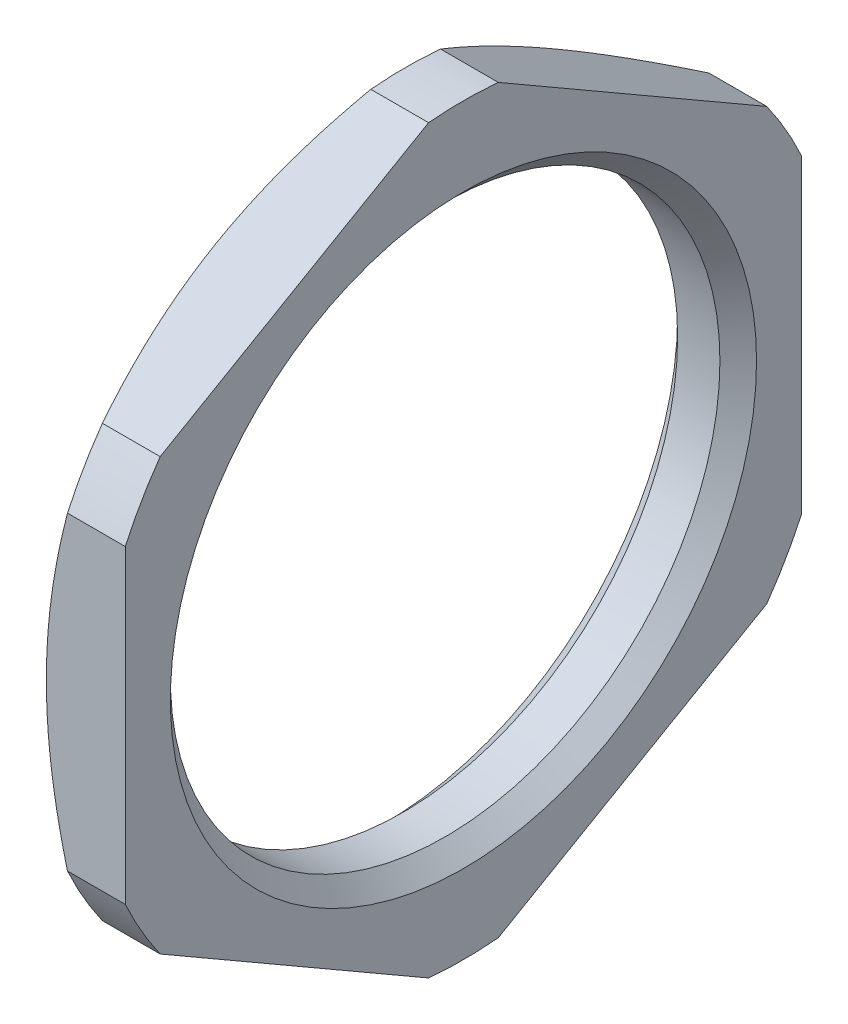
ISO-10303-21;
HEADER;
FILE_DESCRIPTION(('STEP AP214'),'2;1');
FILE_NAME('part.step','',(''),(''),'','','');
FILE_SCHEMA(('AUTOMOTIVE_DESIGN { 1 0 10303 214 1 1 1 1 }'));
ENDSEC;
DATA;
#1=APPLICATION_CONTEXT('core data for automotive mechanical design processes');
#2=APPLICATION_PROTOCOL_DEFINITION('international standard','automotive_design',2000,#1);
#3=PRODUCT_CONTEXT('',#1,'mechanical');
#4=PRODUCT('Part','Part','',(#3));
#5=PRODUCT_RELATED_PRODUCT_CATEGORY('part','',(#4));
#6=PRODUCT_DEFINITION_FORMATION('','',#4);
#7=PRODUCT_DEFINITION_CONTEXT('part definition',#1,'design');
#8=PRODUCT_DEFINITION('design','',#6,#7);
#9=PRODUCT_DEFINITION_SHAPE('','',#8);
#10=(LENGTH_UNIT() NAMED_UNIT(*) SI_UNIT(.MILLI.,.METRE.));
#11=(NAMED_UNIT(*) PLANE_ANGLE_UNIT() SI_UNIT($,.RADIAN.));
#12=(NAMED_UNIT(*) SI_UNIT($,.STERADIAN.) SOLID_ANGLE_UNIT());
#13=UNCERTAINTY_MEASURE_WITH_UNIT(LENGTH_MEASURE(1.E-05),#10,'distance_accuracy_value','');
#14=(GEOMETRIC_REPRESENTATION_CONTEXT(3) GLOBAL_UNCERTAINTY_ASSIGNED_CONTEXT((#13)) GLOBAL_UNIT_ASSIGNED_CONTEXT((#10,
#11,#12)) REPRESENTATION_CONTEXT('',''));
#15=CARTESIAN_POINT('',(0.,0.,0.));
#16=DIRECTION('',(0.,0.,1.));
#17=DIRECTION('',(1.,0.,0.));
#18=AXIS2_PLACEMENT_3D('',#15,#16,#17);
#19=CARTESIAN_POINT('',(0.,13.,0.));
#20=DIRECTION('',(1.,0.,0.));
#21=DIRECTION('',(0.,0.,-1.));
#22=AXIS2_PLACEMENT_3D('',#19,#20,#21);
#23=PLANE('',#22);
#24=DIRECTION('',(0.,-0.5,-0.866025403784439));
#25=VECTOR('',#24,1.);
#26=CARTESIAN_POINT('',(0.,16.2403810567666,-1.87083487540115));
#27=LINE('',#26,#25);
#28=CARTESIAN_POINT('',(0.,16.4273128279835,-1.54705955010467));
#29=VERTEX_POINT('',#28);
#30=CARTESIAN_POINT('',(0.,9.5534492855497,-13.4529404498953));
#31=VERTEX_POINT('',#30);
#32=EDGE_CURVE('E386',#29,#31,#27,.T.);
#33=ORIENTED_EDGE('',*,*,#32,.F.);
#34=CARTESIAN_POINT('',(0.,4.61436444609831E-13,0.));
#35=DIRECTION('',(1.,0.,0.));
#36=DIRECTION('',(0.,0.,-1.));
#37=AXIS2_PLACEMENT_3D('',#34,#35,#36);
#38=CIRCLE('',#37,16.4999999999995);
#39=CARTESIAN_POINT('',(0.,16.4273128279835,1.54705955010467));
#40=VERTEX_POINT('',#39);
#41=EDGE_CURVE('E388',#40,#29,#38,.F.);
#42=ORIENTED_EDGE('',*,*,#41,.F.);
#43=DIRECTION('',(0.,0.5,-0.866025403784439));
#44=VECTOR('',#43,1.);
#45=CARTESIAN_POINT('',(0.,16.2403810567666,1.87083487540115));
#46=LINE('',#45,#44);
#47=CARTESIAN_POINT('',(0.,9.5534492855497,13.4529404498953));
#48=VERTEX_POINT('',#47);
#49=EDGE_CURVE('E150',#48,#40,#46,.T.);
#50=ORIENTED_EDGE('',*,*,#49,.F.);
#51=CARTESIAN_POINT('',(0.,1.17961196366423E-13,1.89084858881472E-13));
#52=DIRECTION('',(1.,0.,0.));
#53=DIRECTION('',(0.,0.,-1.));
#54=AXIS2_PLACEMENT_3D('',#51,#52,#53);
#55=CIRCLE('',#54,16.4999999999998);
#56=CARTESIAN_POINT('',(0.,6.87386354243376,15.));
#57=VERTEX_POINT('',#56);
#58=EDGE_CURVE('E143',#57,#48,#55,.F.);
#59=ORIENTED_EDGE('',*,*,#58,.F.);
#60=DIRECTION('',(0.,1.,0.));
#61=VECTOR('',#60,1.);
#62=CARTESIAN_POINT('',(0.,13.,15.));
#63=LINE('',#62,#61);
#64=CARTESIAN_POINT('',(0.,-6.87386354243375,15.));
#65=VERTEX_POINT('',#64);
#66=EDGE_CURVE('E133',#65,#57,#63,.T.);
#67=ORIENTED_EDGE('',*,*,#66,.F.);
#68=CARTESIAN_POINT('',(0.,-1.86482773667507E-13,3.08780778723872E-13));
#69=DIRECTION('',(1.,0.,0.));
#70=DIRECTION('',(0.,0.,-1.));
#71=AXIS2_PLACEMENT_3D('',#68,#69,#70);
#72=CIRCLE('',#71,16.4999999999996);
#73=CARTESIAN_POINT('',(0.,-9.55344928554969,13.4529404498953));
#74=VERTEX_POINT('',#73);
#75=EDGE_CURVE('E122',#74,#65,#72,.F.);
#76=ORIENTED_EDGE('',*,*,#75,.F.);
#77=DIRECTION('',(0.,0.5,0.866025403784439));
#78=VECTOR('',#77,1.);
#79=CARTESIAN_POINT('',(0.,-9.74038105676658,13.1291651245988));
#80=LINE('',#79,#78);
#81=CARTESIAN_POINT('',(0.,-16.4273128279835,1.54705955010467));
#82=VERTEX_POINT('',#81);
#83=EDGE_CURVE('E127',#82,#74,#80,.T.);
#84=ORIENTED_EDGE('',*,*,#83,.F.);
#85=CARTESIAN_POINT('',(0.,-4.54497550705923E-13,0.));
#86=DIRECTION('',(1.,0.,0.));
#87=DIRECTION('',(0.,0.,-1.));
#88=AXIS2_PLACEMENT_3D('',#85,#86,#87);
#89=CIRCLE('',#88,16.4999999999995);
#90=CARTESIAN_POINT('',(0.,-16.4273128279835,-1.54705955010465));
#91=VERTEX_POINT('',#90);
#92=EDGE_CURVE('E376',#91,#82,#89,.F.);
#93=ORIENTED_EDGE('',*,*,#92,.F.);
#94=DIRECTION('',(0.,-0.5,0.866025403784439));
#95=VECTOR('',#94,1.);
#96=CARTESIAN_POINT('',(0.,-9.74038105676658,-13.1291651245988));
#97=LINE('',#96,#95);
#98=CARTESIAN_POINT('',(0.,-9.5534492855497,-13.4529404498953));
#99=VERTEX_POINT('',#98);
#100=EDGE_CURVE('E378',#99,#91,#97,.T.);
#101=ORIENTED_EDGE('',*,*,#100,.F.);
#102=CARTESIAN_POINT('',(0.,-1.42247325030098E-13,-2.25514051876985E-13));
#103=DIRECTION('',(1.,0.,0.));
#104=DIRECTION('',(0.,0.,-1.));
#105=AXIS2_PLACEMENT_3D('',#102,#103,#104);
#106=CIRCLE('',#105,16.4999999999997);
#107=CARTESIAN_POINT('',(0.,-6.87386354243378,-15.));
#108=VERTEX_POINT('',#107);
#109=EDGE_CURVE('E380',#108,#99,#106,.F.);
#110=ORIENTED_EDGE('',*,*,#109,.F.);
#111=DIRECTION('',(0.,-1.,0.));
#112=VECTOR('',#111,1.);
#113=CARTESIAN_POINT('',(0.,13.,-15.));
#114=LINE('',#113,#112);
#115=CARTESIAN_POINT('',(0.,6.87386354243376,-15.));
#116=VERTEX_POINT('',#115);
#117=EDGE_CURVE('E382',#116,#108,#114,.T.);
#118=ORIENTED_EDGE('',*,*,#117,.F.);
#119=CARTESIAN_POINT('',(0.,1.59594559789866E-13,-2.61943244872498E-13));
#120=DIRECTION('',(1.,0.,0.));
#121=DIRECTION('',(0.,0.,-1.));
#122=AXIS2_PLACEMENT_3D('',#119,#120,#121);
#123=CIRCLE('',#122,16.4999999999997);
#124=EDGE_CURVE('E384',#31,#116,#123,.F.);
#125=ORIENTED_EDGE('',*,*,#124,.F.);
#126=EDGE_LOOP('',(#33,#42,#50,#59,#67,#76,#84,#93,#101,#110,#118,#125));
#127=FACE_BOUND('',#126,.T.);
#128=CARTESIAN_POINT('',(0.,0.,0.));
#129=DIRECTION('',(1.,0.,0.));
#130=DIRECTION('',(0.,0.,-1.));
#131=AXIS2_PLACEMENT_3D('',#128,#129,#130);
#132=CIRCLE('',#131,13.);
#133=CARTESIAN_POINT('',(0.,0.,-13.));
#134=VERTEX_POINT('',#133);
#135=EDGE_CURVE('E155',#134,#134,#132,.T.);
#136=ORIENTED_EDGE('',*,*,#135,.F.);
#137=EDGE_LOOP('',(#136));
#138=FACE_BOUND('',#137,.T.);
#139=ADVANCED_FACE('F17',(#127,#138),#23,.T.);
#140=CARTESIAN_POINT('',(0.,0.,0.));
#141=DIRECTION('',(1.,0.,0.));
#142=DIRECTION('',(0.,0.,-1.));
#143=AXIS2_PLACEMENT_3D('',#140,#141,#142);
#144=CONICAL_SURFACE('',#143,20.6011708516437,1.01229096615671);
#145=CARTESIAN_POINT('',(-2.5626959721363,0.,0.));
#146=DIRECTION('',(1.,0.,0.));
#147=DIRECTION('',(0.,0.,-1.));
#148=AXIS2_PLACEMENT_3D('',#145,#146,#147);
#149=CIRCLE('',#148,16.4999999999995);
#150=CARTESIAN_POINT('',(-2.56269597213601,16.4273128279835,-1.54705955010467));
#151=VERTEX_POINT('',#150);
#152=CARTESIAN_POINT('',(-2.5626959721363,16.4273128279835,1.54705955010467));
#153=VERTEX_POINT('',#152);
#154=EDGE_CURVE('E21',#151,#153,#149,.T.);
#155=ORIENTED_EDGE('',*,*,#154,.F.);
#156=CARTESIAN_POINT('',(-2.56263585315932,9.55333381549586,-13.4531404498953));
#157=CARTESIAN_POINT('',(-2.65908235373302,9.7385574133591,-13.1323237676355));
#158=CARTESIAN_POINT('',(-2.74949322487026,9.92459425722548,-12.8100985019792));
#159=CARTESIAN_POINT('',(-2.91683421351829,10.2982457824955,-12.1629150758859));
#160=CARTESIAN_POINT('',(-2.99375932497931,10.4858610228464,-11.8379559473238));
#161=CARTESIAN_POINT('',(-3.13273861794101,10.8627352300099,-11.1851906724545));
#162=CARTESIAN_POINT('',(-3.19477276590874,11.0519960601388,-10.8573812987886));
#163=CARTESIAN_POINT('',(-3.30250179245375,11.4316601173994,-10.1997838618054));
#164=CARTESIAN_POINT('',(-3.34819872649331,11.6220631977522,-9.86999605271679));
#165=CARTESIAN_POINT('',(-3.421327625553,11.9993446134886,-9.21652547190977));
#166=CARTESIAN_POINT('',(-3.44915424418849,12.1862037037887,-8.89287603365395));
#167=CARTESIAN_POINT('',(-3.48749923490198,12.5603770516881,-8.24478878425399));
#168=CARTESIAN_POINT('',(-3.49801685889976,12.7476913286099,-7.92035093964245));
#169=CARTESIAN_POINT('',(-3.50147096357484,13.1221878279301,-7.27170397556315));
#170=CARTESIAN_POINT('',(-3.49442367125168,13.3093700125321,-6.9474949215607));
#171=CARTESIAN_POINT('',(-3.46296459576616,13.6833496031031,-6.29974326969805));
#172=CARTESIAN_POINT('',(-3.43855429688613,13.8701470405934,-5.97620061724114));
#173=CARTESIAN_POINT('',(-3.37078111381775,14.2554540675784,-5.3088292699898));
#174=CARTESIAN_POINT('',(-3.3262612520597,14.4539126039753,-4.96508900175467));
#175=CARTESIAN_POINT('',(-3.21930656681731,14.8496304903112,-4.27968551715698));
#176=CARTESIAN_POINT('',(-3.15686987589528,15.0468897130584,-3.93802252109729));
#177=CARTESIAN_POINT('',(-3.01465870011628,15.4424125565591,-3.25295686060003));
#178=CARTESIAN_POINT('',(-2.9346740672792,15.6406571100011,-2.90958722171468));
#179=CARTESIAN_POINT('',(-2.7595773343317,16.035380382701,-2.22590645846868));
#180=CARTESIAN_POINT('',(-2.66447207355708,16.2318598580874,-1.88559402445496));
#181=CARTESIAN_POINT('',(-2.56263585315932,16.4274282980373,-1.54685955010467));
#182=B_SPLINE_CURVE_WITH_KNOTS('',3,(#156,#157,#158,#159,#160,#161,#162,#163,#164,#165,#166,
#167,#168,#169,#170,#171,#172,#173,#174,#175,#176,#177,#178,#179,#180,#181),.UNSPECIFIED.,.F.,
.F.,(4,2,2,2,2,2,2,2,2,2,2,2,4),(0.,1.14841775169811,2.29726090908601,3.44764110538156,
4.59787651591857,5.72174665781679,6.84566537116399,7.96854615942511,9.09133096938621,
10.2891084657342,11.4870108495693,12.7001287542977,13.9126994966303),.UNSPECIFIED.);
#183=CARTESIAN_POINT('',(-3.5,12.9903810567666,-7.5));
#184=VERTEX_POINT('',#183);
#185=EDGE_CURVE('E11',#184,#151,#182,.T.);
#186=ORIENTED_EDGE('',*,*,#185,.F.);
#187=CARTESIAN_POINT('',(-3.5,0.,0.));
#188=DIRECTION('',(1.,0.,0.));
#189=DIRECTION('',(0.,0.,-1.));
#190=AXIS2_PLACEMENT_3D('',#187,#188,#189);
#191=CIRCLE('',#190,15.);
#192=CARTESIAN_POINT('',(-3.5,12.9903810567666,7.49999999999999));
#193=VERTEX_POINT('',#192);
#194=EDGE_CURVE('E149',#184,#193,#191,.T.);
#195=ORIENTED_EDGE('',*,*,#194,.T.);
#196=CARTESIAN_POINT('',(-2.56263585315932,16.4274282980373,1.54685955010467));
#197=CARTESIAN_POINT('',(-2.65908235373302,16.2422047001741,1.8676762323645));
#198=CARTESIAN_POINT('',(-2.74949322487026,16.0561678563077,2.18990149802083));
#199=CARTESIAN_POINT('',(-2.91683421351829,15.6825163310377,2.83708492411411));
#200=CARTESIAN_POINT('',(-2.99375932497932,15.4949010906867,3.1620440526762));
#201=CARTESIAN_POINT('',(-3.13273861794101,15.1180268835233,3.81480932754551));
#202=CARTESIAN_POINT('',(-3.19477276590874,14.9287660533944,4.14261870121144));
#203=CARTESIAN_POINT('',(-3.30250179245375,14.5491019961337,4.80021613819462));
#204=CARTESIAN_POINT('',(-3.34819872649331,14.358698915781,5.13000394728321));
#205=CARTESIAN_POINT('',(-3.42132762555301,13.9814175000445,5.78347452809022));
#206=CARTESIAN_POINT('',(-3.44915424418849,13.7945584097445,6.10712396634604));
#207=CARTESIAN_POINT('',(-3.48749923490198,13.420385061845,6.755211215746));
#208=CARTESIAN_POINT('',(-3.49801685889976,13.2330707849233,7.07964906035754));
#209=CARTESIAN_POINT('',(-3.50147096357484,12.858574285603,7.72829602443684));
#210=CARTESIAN_POINT('',(-3.49442367125168,12.671392101001,8.05250507843929));
#211=CARTESIAN_POINT('',(-3.46296459576615,12.2974125104301,8.70025673030194));
#212=CARTESIAN_POINT('',(-3.43855429688613,12.1106150729398,9.02379938275885));
#213=CARTESIAN_POINT('',(-3.37078111381775,11.7253080459548,9.69117073001019));
#214=CARTESIAN_POINT('',(-3.3262612520597,11.5268495095579,10.0349109982453));
#215=CARTESIAN_POINT('',(-3.21930656681731,11.1311316232219,10.720314482843));
#216=CARTESIAN_POINT('',(-3.15686987589528,10.9338724004747,11.0619774789027));
#217=CARTESIAN_POINT('',(-3.01465870011628,10.5383495569741,11.7470431394));
#218=CARTESIAN_POINT('',(-2.9346740672792,10.3401050035321,12.0904127782853));
#219=CARTESIAN_POINT('',(-2.7595773343317,9.94538173083221,12.7740935415313));
#220=CARTESIAN_POINT('',(-2.66447207355708,9.74890225544581,13.114405975545));
#221=CARTESIAN_POINT('',(-2.56263585315932,9.55333381549586,13.4531404498953));
#222=B_SPLINE_CURVE_WITH_KNOTS('',3,(#196,#197,#198,#199,#200,#201,#202,#203,#204,#205,#206,
#207,#208,#209,#210,#211,#212,#213,#214,#215,#216,#217,#218,#219,#220,#221),.UNSPECIFIED.,.F.,
.F.,(4,2,2,2,2,2,2,2,2,2,2,2,4),(0.,1.14841775169811,2.29726090908601,3.44764110538156,
4.59787651591857,5.72174665781679,6.84566537116399,7.96854615942511,9.09133096938621,
10.2891084657342,11.4870108495693,12.7001287542977,13.9126994966303),.UNSPECIFIED.);
#223=EDGE_CURVE('E252',#153,#193,#222,.T.);
#224=ORIENTED_EDGE('',*,*,#223,.F.);
#225=EDGE_LOOP('',(#155,#186,#195,#224));
#226=FACE_BOUND('',#225,.T.);
#227=ADVANCED_FACE('F201',(#226),#144,.T.);
#228=CARTESIAN_POINT('',(-2.5626959721362,9.5534492855497,-13.4529404498953));
#229=VERTEX_POINT('',#228);
#230=EDGE_CURVE('E26',#229,#184,#182,.T.);
#231=ORIENTED_EDGE('',*,*,#230,.F.);
#232=CARTESIAN_POINT('',(-2.5626959721362,0.,0.));
#233=DIRECTION('',(1.,0.,0.));
#234=DIRECTION('',(0.,0.,-1.));
#235=AXIS2_PLACEMENT_3D('',#232,#233,#234);
#236=CIRCLE('',#235,16.4999999999997);
#237=CARTESIAN_POINT('',(-2.56269597213601,6.87386354243376,-15.));
#238=VERTEX_POINT('',#237);
#239=EDGE_CURVE('E246',#238,#229,#236,.T.);
#240=ORIENTED_EDGE('',*,*,#239,.F.);
#241=CARTESIAN_POINT('',(3.28363644863905,-21.0603245015449,-15.));
#242=CARTESIAN_POINT('',(3.02226580849374,-20.5467045332583,-15.));
#243=CARTESIAN_POINT('',(2.76337422034225,-20.031806544742,-15.));
#244=CARTESIAN_POINT('',(2.2516386395723,-18.9989494975446,-15.));
#245=CARTESIAN_POINT('',(1.99879528331884,-18.4809901238474,-15.));
#246=CARTESIAN_POINT('',(1.49963109749312,-17.4402161656836,-15.));
#247=CARTESIAN_POINT('',(1.25332962141577,-16.9173922744051,-15.));
#248=CARTESIAN_POINT('',(0.769439563641048,-15.8677359705719,-15.));
#249=CARTESIAN_POINT('',(0.53185074418826,-15.3409036678752,-15.));
#250=CARTESIAN_POINT('',(0.0591780003961451,-14.2643273837263,-15.));
#251=CARTESIAN_POINT('',(-0.175536149884083,-13.7144204136875,-15.));
#252=CARTESIAN_POINT('',(-0.631167637862706,-12.6088681677198,-15.));
#253=CARTESIAN_POINT('',(-0.852084346352585,-12.0532226314381,-15.));
#254=CARTESIAN_POINT('',(-1.27674996569557,-10.9358925270728,-15.));
#255=CARTESIAN_POINT('',(-1.48051312837813,-10.374213418343,-15.));
#256=CARTESIAN_POINT('',(-1.86711686069021,-9.2437634724032,-15.));
#257=CARTESIAN_POINT('',(-2.04995990514609,-8.67499348288285,-15.));
#258=CARTESIAN_POINT('',(-2.44359843525671,-7.34945662464575,-15.));
#259=CARTESIAN_POINT('',(-2.64509100557299,-6.58983928992869,-15.));
#260=CARTESIAN_POINT('',(-2.90493894737911,-5.44088078320724,-15.));
#261=CARTESIAN_POINT('',(-2.9844924701367,-5.05628788528871,-15.));
#262=CARTESIAN_POINT('',(-3.12791053767496,-4.2842052007124,-15.));
#263=CARTESIAN_POINT('',(-3.19177706749874,-3.8967157869827,-15.));
#264=CARTESIAN_POINT('',(-3.30164164090044,-3.12462550746446,-15.));
#265=CARTESIAN_POINT('',(-3.3478729382095,-2.74005800898397,-15.));
#266=CARTESIAN_POINT('',(-3.42257015673633,-1.96919136052442,-15.));
#267=CARTESIAN_POINT('',(-3.4510362892835,-1.58289223119942,-15.));
#268=CARTESIAN_POINT('',(-3.48945451561525,-0.809417707443591,-15.));
#269=CARTESIAN_POINT('',(-3.49940902692248,-0.422242434045786,-15.));
#270=CARTESIAN_POINT('',(-3.50053978699422,0.352136099812851,-15.));
#271=CARTESIAN_POINT('',(-3.49171601908732,0.739339360298226,-15.));
#272=CARTESIAN_POINT('',(-3.45551981799826,1.51311462475509,-15.));
#273=CARTESIAN_POINT('',(-3.42813574611875,1.89968607997557,-15.));
#274=CARTESIAN_POINT('',(-3.3555284627567,2.67113871400078,-15.));
#275=CARTESIAN_POINT('',(-3.31030510635863,3.05601987904893,-15.));
#276=CARTESIAN_POINT('',(-3.20311379455301,3.82350874950389,-15.));
#277=CARTESIAN_POINT('',(-3.14114250123942,4.20611598615926,-15.));
#278=CARTESIAN_POINT('',(-3.00181778004916,4.96853198466155,-15.));
#279=CARTESIAN_POINT('',(-2.92446251883097,5.34834040736768,-15.));
#280=CARTESIAN_POINT('',(-2.66929898805376,6.49325639353585,-15.));
#281=CARTESIAN_POINT('',(-2.46989291393973,7.25361584537219,-15.));
#282=CARTESIAN_POINT('',(-2.13728726093256,8.38392855363827,-15.));
#283=CARTESIAN_POINT('',(-2.02082941169467,8.75901321225045,-15.));
#284=CARTESIAN_POINT('',(-1.77809467414387,9.50599541191148,-15.));
#285=CARTESIAN_POINT('',(-1.65181816063402,9.8778930740149,-15.));
#286=CARTESIAN_POINT('',(-1.35481855220867,10.7204418056363,-15.));
#287=CARTESIAN_POINT('',(-1.18141758264995,11.1901453018913,-15.));
#288=CARTESIAN_POINT('',(-0.822924090227282,12.1250662789637,-15.));
#289=CARTESIAN_POINT('',(-0.63783119165446,12.5902836150685,-15.));
#290=CARTESIAN_POINT('',(-0.257771363899292,13.5167952279827,-15.));
#291=CARTESIAN_POINT('',(-0.0628018899767382,13.978088457605,-15.));
#292=CARTESIAN_POINT('',(0.335425748100482,14.8970842337759,-15.));
#293=CARTESIAN_POINT('',(0.538684073004849,15.3547867104818,-15.));
#294=CARTESIAN_POINT('',(0.946194139644611,16.2537289251484,-15.));
#295=CARTESIAN_POINT('',(1.1502447389422,16.695060052218,-15.));
#296=CARTESIAN_POINT('',(1.56399841670599,17.5750675431914,-15.));
#297=CARTESIAN_POINT('',(1.77370156714235,18.0137438732063,-15.));
#298=CARTESIAN_POINT('',(2.1977261897927,18.8882757526274,-15.));
#299=CARTESIAN_POINT('',(2.41204248757853,19.3241338153288,-15.));
#300=CARTESIAN_POINT('',(2.84485890527086,20.1937402057334,-15.));
#301=CARTESIAN_POINT('',(3.0633588038744,20.6274886435172,-15.));
#302=CARTESIAN_POINT('',(3.28363644863905,21.0603245015449,-15.));
#303=B_SPLINE_CURVE_WITH_KNOTS('',3,(#241,#242,#243,#244,#245,#246,#247,#248,#249,#250,#251,
#252,#253,#254,#255,#256,#257,#258,#259,#260,#261,#262,#263,#264,#265,#266,#267,#268,#269,#270,
#271,#272,#273,#274,#275,#276,#277,#278,#279,#280,#281,#282,#283,#284,#285,#286,#287,#288,#289,
#290,#291,#292,#293,#294,#295,#296,#297,#298,#299,#300,#301,#302),.UNSPECIFIED.,.F.,.F.,(4,2,2,
2,2,2,2,2,2,2,2,2,2,2,2,2,2,2,2,2,2,2,2,2,2,2,2,2,2,2,4),(0.,1.72891094509327,3.45800300456291,
5.19174156100206,6.92543277104048,8.71898814750664,10.5126252563369,12.3047571240048,
14.096676764814,16.4523384281841,17.6302780448192,18.8080685272671,19.9696909371389,
21.1312995284148,22.2927564089193,23.4542143205678,24.6164012277693,25.7785975760667,
26.9410257240618,28.103592484293,30.4596892988144,31.6378534195165,32.8159725887946,
34.3178516497595,35.819778996736,37.3220953094868,38.8244407712539,40.2830547632718,
41.7416873356333,43.1987612626864,44.6557583256291),.UNSPECIFIED.);
#304=CARTESIAN_POINT('',(-3.50000000000004,0.,-15.));
#305=VERTEX_POINT('',#304);
#306=EDGE_CURVE('E248',#305,#238,#303,.T.);
#307=ORIENTED_EDGE('',*,*,#306,.F.);
#308=EDGE_CURVE('E144',#305,#184,#191,.T.);
#309=ORIENTED_EDGE('',*,*,#308,.T.);
#310=EDGE_LOOP('',(#231,#240,#307,#309));
#311=FACE_BOUND('',#310,.T.);
#312=ADVANCED_FACE('F205',(#311),#144,.T.);
#313=CARTESIAN_POINT('',(-2.56269597213601,9.5534492855497,13.4529404498953));
#314=VERTEX_POINT('',#313);
#315=EDGE_CURVE('E256',#193,#314,#222,.T.);
#316=ORIENTED_EDGE('',*,*,#315,.F.);
#317=CARTESIAN_POINT('',(-3.50000000000004,0.,15.));
#318=VERTEX_POINT('',#317);
#319=EDGE_CURVE('E156',#193,#318,#191,.T.);
#320=ORIENTED_EDGE('',*,*,#319,.T.);
#321=CARTESIAN_POINT('',(3.28363644863903,21.0603245015449,15.));
#322=CARTESIAN_POINT('',(3.02226580849372,20.5467045332583,15.));
#323=CARTESIAN_POINT('',(2.76337422034224,20.031806544742,15.));
#324=CARTESIAN_POINT('',(2.25163863957228,18.9989494975445,15.));
#325=CARTESIAN_POINT('',(1.99879528331882,18.4809901238474,15.));
#326=CARTESIAN_POINT('',(1.49963109749311,17.4402161656835,15.));
#327=CARTESIAN_POINT('',(1.25332962141576,16.9173922744051,15.));
#328=CARTESIAN_POINT('',(0.769439563641031,15.8677359705719,15.));
#329=CARTESIAN_POINT('',(0.531850744188244,15.3409036678752,15.));
#330=CARTESIAN_POINT('',(0.0591780003961306,14.2643273837263,15.));
#331=CARTESIAN_POINT('',(-0.175536149884097,13.7144204136875,15.));
#332=CARTESIAN_POINT('',(-0.631167637862718,12.6088681677198,15.));
#333=CARTESIAN_POINT('',(-0.852084346352597,12.0532226314381,15.));
#334=CARTESIAN_POINT('',(-1.27674996569558,10.9358925270728,15.));
#335=CARTESIAN_POINT('',(-1.48051312837814,10.3742134183429,15.));
#336=CARTESIAN_POINT('',(-1.86711686069022,9.24376347240316,15.));
#337=CARTESIAN_POINT('',(-2.04995990514611,8.67499348288282,15.));
#338=CARTESIAN_POINT('',(-2.44359843525672,7.34945662464572,15.));
#339=CARTESIAN_POINT('',(-2.645091005573,6.58983928992865,15.));
#340=CARTESIAN_POINT('',(-2.90493894737912,5.4408807832072,15.));
#341=CARTESIAN_POINT('',(-2.98449247013671,5.05628788528867,15.));
#342=CARTESIAN_POINT('',(-3.12791053767497,4.28420520071237,15.));
#343=CARTESIAN_POINT('',(-3.19177706749874,3.89671578698266,15.));
#344=CARTESIAN_POINT('',(-3.30164164090045,3.12462550746443,15.));
#345=CARTESIAN_POINT('',(-3.3478729382095,2.74005800898394,15.));
#346=CARTESIAN_POINT('',(-3.42257015673633,1.96919136052439,15.));
#347=CARTESIAN_POINT('',(-3.4510362892835,1.58289223119939,15.));
#348=CARTESIAN_POINT('',(-3.48945451561525,0.809417707443559,15.));
#349=CARTESIAN_POINT('',(-3.49940902692249,0.422242434045755,15.));
#350=CARTESIAN_POINT('',(-3.50053978699422,-0.352136099812883,15.));
#351=CARTESIAN_POINT('',(-3.49171601908732,-0.739339360298259,15.));
#352=CARTESIAN_POINT('',(-3.45551981799826,-1.51311462475512,15.));
#353=CARTESIAN_POINT('',(-3.42813574611875,-1.8996860799756,15.));
#354=CARTESIAN_POINT('',(-3.35552846275669,-2.67113871400081,15.));
#355=CARTESIAN_POINT('',(-3.31030510635862,-3.05601987904896,15.));
#356=CARTESIAN_POINT('',(-3.203113794553,-3.82350874950393,15.));
#357=CARTESIAN_POINT('',(-3.14114250123942,-4.20611598615929,15.));
#358=CARTESIAN_POINT('',(-3.00181778004915,-4.96853198466158,15.));
#359=CARTESIAN_POINT('',(-2.92446251883097,-5.34834040736771,15.));
#360=CARTESIAN_POINT('',(-2.66929898805375,-6.49325639353588,15.));
#361=CARTESIAN_POINT('',(-2.46989291393973,-7.25361584537222,15.));
#362=CARTESIAN_POINT('',(-2.13728726093255,-8.38392855363829,15.));
#363=CARTESIAN_POINT('',(-2.02082941169466,-8.75901321225048,15.));
#364=CARTESIAN_POINT('',(-1.77809467414386,-9.50599541191151,15.));
#365=CARTESIAN_POINT('',(-1.65181816063401,-9.87789307401493,15.));
#366=CARTESIAN_POINT('',(-1.35481855220867,-10.7204418056363,15.));
#367=CARTESIAN_POINT('',(-1.18141758264995,-11.1901453018913,15.));
#368=CARTESIAN_POINT('',(-0.822924090227276,-12.1250662789637,15.));
#369=CARTESIAN_POINT('',(-0.637831191654456,-12.5902836150685,15.));
#370=CARTESIAN_POINT('',(-0.25777136389929,-13.5167952279827,15.));
#371=CARTESIAN_POINT('',(-0.0628018899767354,-13.978088457605,15.));
#372=CARTESIAN_POINT('',(0.335425748100484,-14.8970842337759,15.));
#373=CARTESIAN_POINT('',(0.538684073004849,-15.3547867104818,15.));
#374=CARTESIAN_POINT('',(0.946194139644609,-16.2537289251484,15.));
#375=CARTESIAN_POINT('',(1.1502447389422,-16.695060052218,15.));
#376=CARTESIAN_POINT('',(1.56399841670598,-17.5750675431914,15.));
#377=CARTESIAN_POINT('',(1.77370156714235,-18.0137438732063,15.));
#378=CARTESIAN_POINT('',(2.19772618979268,-18.8882757526274,15.));
#379=CARTESIAN_POINT('',(2.41204248757852,-19.3241338153288,15.));
#380=CARTESIAN_POINT('',(2.84485890527084,-20.1937402057334,15.));
#381=CARTESIAN_POINT('',(3.06335880387438,-20.6274886435172,15.));
#382=CARTESIAN_POINT('',(3.28363644863903,-21.0603245015448,15.));
#383=B_SPLINE_CURVE_WITH_KNOTS('',3,(#321,#322,#323,#324,#325,#326,#327,#328,#329,#330,#331,
#332,#333,#334,#335,#336,#337,#338,#339,#340,#341,#342,#343,#344,#345,#346,#347,#348,#349,#350,
#351,#352,#353,#354,#355,#356,#357,#358,#359,#360,#361,#362,#363,#364,#365,#366,#367,#368,#369,
#370,#371,#372,#373,#374,#375,#376,#377,#378,#379,#380,#381,#382),.UNSPECIFIED.,.F.,.F.,(4,2,2,
2,2,2,2,2,2,2,2,2,2,2,2,2,2,2,2,2,2,2,2,2,2,2,2,2,2,2,4),(0.,1.72891094509327,3.45800300456291,
5.19174156100206,6.92543277104047,8.71898814750664,10.5126252563369,12.3047571240048,
14.096676764814,16.4523384281841,17.6302780448192,18.8080685272671,19.9696909371389,
21.1312995284148,22.2927564089192,23.4542143205678,24.6164012277693,25.7785975760667,
26.9410257240618,28.103592484293,30.4596892988144,31.6378534195164,32.8159725887946,
34.3178516497595,35.8197789967359,37.3220953094868,38.8244407712539,40.2830547632717,
41.7416873356332,43.1987612626864,44.655758325629),.UNSPECIFIED.);
#384=CARTESIAN_POINT('',(-2.56269597213615,6.87386354243376,15.));
#385=VERTEX_POINT('',#384);
#386=EDGE_CURVE('E351',#385,#318,#383,.T.);
#387=ORIENTED_EDGE('',*,*,#386,.F.);
#388=CARTESIAN_POINT('',(-2.56269597213615,0.,0.));
#389=DIRECTION('',(1.,0.,0.));
#390=DIRECTION('',(0.,0.,-1.));
#391=AXIS2_PLACEMENT_3D('',#388,#389,#390);
#392=CIRCLE('',#391,16.4999999999998);
#393=EDGE_CURVE('E272',#314,#385,#392,.T.);
#394=ORIENTED_EDGE('',*,*,#393,.F.);
#395=EDGE_LOOP('',(#316,#320,#387,#394));
#396=FACE_BOUND('',#395,.T.);
#397=ADVANCED_FACE('F331',(#396),#144,.T.);
#398=CARTESIAN_POINT('',(-2.56269597213618,-6.87386354243378,-15.));
#399=VERTEX_POINT('',#398);
#400=EDGE_CURVE('E254',#399,#305,#303,.T.);
#401=ORIENTED_EDGE('',*,*,#400,.F.);
#402=CARTESIAN_POINT('',(-2.56269597213618,0.,0.));
#403=DIRECTION('',(1.,0.,0.));
#404=DIRECTION('',(0.,0.,-1.));
#405=AXIS2_PLACEMENT_3D('',#402,#403,#404);
#406=CIRCLE('',#405,16.4999999999997);
#407=CARTESIAN_POINT('',(-2.56269597213601,-9.5534492855497,-13.4529404498953));
#408=VERTEX_POINT('',#407);
#409=EDGE_CURVE('E264',#408,#399,#406,.T.);
#410=ORIENTED_EDGE('',*,*,#409,.F.);
#411=CARTESIAN_POINT('',(-2.56263585315932,-16.4274282980373,-1.54685955010465));
#412=CARTESIAN_POINT('',(-2.65908235373302,-16.2422047001741,-1.86767623236449));
#413=CARTESIAN_POINT('',(-2.74949322487026,-16.0561678563077,-2.18990149802081));
#414=CARTESIAN_POINT('',(-2.91683421351829,-15.6825163310377,-2.8370849241141));
#415=CARTESIAN_POINT('',(-2.99375932497931,-15.4949010906867,-3.16204405267618));
#416=CARTESIAN_POINT('',(-3.13273861794101,-15.1180268835233,-3.8148093275455));
#417=CARTESIAN_POINT('',(-3.19477276590874,-14.9287660533944,-4.14261870121143));
#418=CARTESIAN_POINT('',(-3.30250179245375,-14.5491019961337,-4.80021613819461));
#419=CARTESIAN_POINT('',(-3.34819872649331,-14.358698915781,-5.13000394728319));
#420=CARTESIAN_POINT('',(-3.421327625553,-13.9814175000445,-5.78347452809021));
#421=CARTESIAN_POINT('',(-3.44915424418849,-13.7945584097445,-6.10712396634603));
#422=CARTESIAN_POINT('',(-3.48749923490198,-13.420385061845,-6.75521121574599));
#423=CARTESIAN_POINT('',(-3.49801685889976,-13.2330707849233,-7.07964906035753));
#424=CARTESIAN_POINT('',(-3.50147096357484,-12.8585742856031,-7.72829602443683));
#425=CARTESIAN_POINT('',(-3.49442367125168,-12.671392101001,-8.05250507843928));
#426=CARTESIAN_POINT('',(-3.46296459576616,-12.2974125104301,-8.70025673030193));
#427=CARTESIAN_POINT('',(-3.43855429688613,-12.1106150729398,-9.02379938275884));
#428=CARTESIAN_POINT('',(-3.37078111381775,-11.7253080459548,-9.69117073001018));
#429=CARTESIAN_POINT('',(-3.32626125205971,-11.5268495095579,-10.0349109982453));
#430=CARTESIAN_POINT('',(-3.21930656681732,-11.1311316232219,-10.720314482843));
#431=CARTESIAN_POINT('',(-3.15686987589528,-10.9338724004747,-11.0619774789027));
#432=CARTESIAN_POINT('',(-3.01465870011628,-10.5383495569741,-11.7470431394));
#433=CARTESIAN_POINT('',(-2.9346740672792,-10.3401050035321,-12.0904127782853));
#434=CARTESIAN_POINT('',(-2.7595773343317,-9.94538173083221,-12.7740935415313));
#435=CARTESIAN_POINT('',(-2.66447207355708,-9.74890225544581,-13.114405975545));
#436=CARTESIAN_POINT('',(-2.56263585315932,-9.55333381549586,-13.4531404498953));
#437=B_SPLINE_CURVE_WITH_KNOTS('',3,(#411,#412,#413,#414,#415,#416,#417,#418,#419,#420,#421,
#422,#423,#424,#425,#426,#427,#428,#429,#430,#431,#432,#433,#434,#435,#436),.UNSPECIFIED.,.F.,
.F.,(4,2,2,2,2,2,2,2,2,2,2,2,4),(0.,1.14841775169811,2.29726090908601,3.44764110538156,
4.59787651591857,5.72174665781679,6.845665371164,7.96854615942511,9.09133096938622,
10.2891084657343,11.4870108495693,12.7001287542977,13.9126994966304),.UNSPECIFIED.);
#438=CARTESIAN_POINT('',(-3.5,-12.9903810567666,-7.49999999999999));
#439=VERTEX_POINT('',#438);
#440=EDGE_CURVE('E267',#439,#408,#437,.T.);
#441=ORIENTED_EDGE('',*,*,#440,.F.);
#442=EDGE_CURVE('E147',#439,#305,#191,.T.);
#443=ORIENTED_EDGE('',*,*,#442,.T.);
#444=EDGE_LOOP('',(#401,#410,#441,#443));
#445=FACE_BOUND('',#444,.T.);
#446=ADVANCED_FACE('F326',(#445),#144,.T.);
#447=CARTESIAN_POINT('',(-2.56269597213629,-16.4273128279835,-1.54705955010465));
#448=VERTEX_POINT('',#447);
#449=EDGE_CURVE('E274',#448,#439,#437,.T.);
#450=ORIENTED_EDGE('',*,*,#449,.F.);
#451=CARTESIAN_POINT('',(-2.56269597213629,0.,0.));
#452=DIRECTION('',(1.,0.,0.));
#453=DIRECTION('',(0.,0.,-1.));
#454=AXIS2_PLACEMENT_3D('',#451,#452,#453);
#455=CIRCLE('',#454,16.4999999999995);
#456=CARTESIAN_POINT('',(-2.56269597213601,-16.4273128279835,1.54705955010467));
#457=VERTEX_POINT('',#456);
#458=EDGE_CURVE('E280',#457,#448,#455,.T.);
#459=ORIENTED_EDGE('',*,*,#458,.F.);
#460=CARTESIAN_POINT('',(-2.56263585315932,-9.55333381549586,13.4531404498953));
#461=CARTESIAN_POINT('',(-2.65908235373302,-9.7385574133591,13.1323237676355));
#462=CARTESIAN_POINT('',(-2.74949322487026,-9.92459425722548,12.8100985019792));
#463=CARTESIAN_POINT('',(-2.91683421351829,-10.2982457824955,12.1629150758859));
#464=CARTESIAN_POINT('',(-2.99375932497931,-10.4858610228464,11.8379559473238));
#465=CARTESIAN_POINT('',(-3.13273861794101,-10.8627352300099,11.1851906724545));
#466=CARTESIAN_POINT('',(-3.19477276590874,-11.0519960601388,10.8573812987886));
#467=CARTESIAN_POINT('',(-3.30250179245375,-11.4316601173994,10.1997838618054));
#468=CARTESIAN_POINT('',(-3.34819872649331,-11.6220631977522,9.86999605271679));
#469=CARTESIAN_POINT('',(-3.42132762555301,-11.9993446134886,9.21652547190978));
#470=CARTESIAN_POINT('',(-3.44915424418849,-12.1862037037887,8.89287603365395));
#471=CARTESIAN_POINT('',(-3.48749923490198,-12.5603770516881,8.24478878425399));
#472=CARTESIAN_POINT('',(-3.49801685889976,-12.7476913286099,7.92035093964245));
#473=CARTESIAN_POINT('',(-3.50147096357484,-13.1221878279301,7.27170397556315));
#474=CARTESIAN_POINT('',(-3.49442367125168,-13.3093700125321,6.94749492156071));
#475=CARTESIAN_POINT('',(-3.46296459576616,-13.6833496031031,6.29974326969806));
#476=CARTESIAN_POINT('',(-3.43855429688613,-13.8701470405934,5.97620061724114));
#477=CARTESIAN_POINT('',(-3.37078111381775,-14.2554540675784,5.30882926998981));
#478=CARTESIAN_POINT('',(-3.3262612520597,-14.4539126039753,4.96508900175467));
#479=CARTESIAN_POINT('',(-3.21930656681731,-14.8496304903112,4.27968551715698));
#480=CARTESIAN_POINT('',(-3.15686987589528,-15.0468897130584,3.93802252109729));
#481=CARTESIAN_POINT('',(-3.01465870011628,-15.4424125565591,3.25295686060003));
#482=CARTESIAN_POINT('',(-2.9346740672792,-15.6406571100011,2.90958722171468));
#483=CARTESIAN_POINT('',(-2.7595773343317,-16.035380382701,2.22590645846868));
#484=CARTESIAN_POINT('',(-2.66447207355708,-16.2318598580874,1.88559402445496));
#485=CARTESIAN_POINT('',(-2.56263585315932,-16.4274282980373,1.54685955010467));
#486=B_SPLINE_CURVE_WITH_KNOTS('',3,(#460,#461,#462,#463,#464,#465,#466,#467,#468,#469,#470,
#471,#472,#473,#474,#475,#476,#477,#478,#479,#480,#481,#482,#483,#484,#485),.UNSPECIFIED.,.F.,
.F.,(4,2,2,2,2,2,2,2,2,2,2,2,4),(0.,1.14841775169811,2.29726090908601,3.44764110538156,
4.59787651591857,5.72174665781679,6.84566537116399,7.96854615942511,9.09133096938621,
10.2891084657342,11.4870108495693,12.7001287542977,13.9126994966303),.UNSPECIFIED.);
#487=CARTESIAN_POINT('',(-3.5,-12.9903810567666,7.5));
#488=VERTEX_POINT('',#487);
#489=EDGE_CURVE('E178',#488,#457,#486,.T.);
#490=ORIENTED_EDGE('',*,*,#489,.F.);
#491=EDGE_CURVE('E338',#488,#439,#191,.T.);
#492=ORIENTED_EDGE('',*,*,#491,.T.);
#493=EDGE_LOOP('',(#450,#459,#490,#492));
#494=FACE_BOUND('',#493,.T.);
#495=ADVANCED_FACE('F221',(#494),#144,.T.);
#496=CARTESIAN_POINT('',(-3.5,15.,0.));
#497=DIRECTION('',(-1.,0.,0.));
#498=DIRECTION('',(0.,0.,1.));
#499=AXIS2_PLACEMENT_3D('',#496,#497,#498);
#500=PLANE('',#499);
#501=CARTESIAN_POINT('',(-3.5,0.,0.));
#502=DIRECTION('',(1.,0.,0.));
#503=DIRECTION('',(0.,0.,-1.));
#504=AXIS2_PLACEMENT_3D('',#501,#502,#503);
#505=CIRCLE('',#504,13.);
#506=CARTESIAN_POINT('',(-3.5,0.,-13.));
#507=VERTEX_POINT('',#506);
#508=EDGE_CURVE('E165',#507,#507,#505,.T.);
#509=ORIENTED_EDGE('',*,*,#508,.T.);
#510=EDGE_LOOP('',(#509));
#511=FACE_BOUND('',#510,.T.);
#512=ORIENTED_EDGE('',*,*,#194,.F.);
#513=ORIENTED_EDGE('',*,*,#308,.F.);
#514=ORIENTED_EDGE('',*,*,#442,.F.);
#515=ORIENTED_EDGE('',*,*,#491,.F.);
#516=EDGE_CURVE('E345',#318,#488,#191,.T.);
#517=ORIENTED_EDGE('',*,*,#516,.F.);
#518=ORIENTED_EDGE('',*,*,#319,.F.);
#519=EDGE_LOOP('',(#512,#513,#514,#515,#517,#518));
#520=FACE_BOUND('',#519,.T.);
#521=ADVANCED_FACE('F19',(#511,#520),#500,.T.);
#522=CARTESIAN_POINT('',(-3.5,0.,0.));
#523=DIRECTION('',(-1.,0.,0.));
#524=DIRECTION('',(0.,0.,1.));
#525=AXIS2_PLACEMENT_3D('',#522,#523,#524);
#526=CONICAL_SURFACE('',#525,13.,0.785398163397449);
#527=CARTESIAN_POINT('',(-2.688,0.,0.));
#528=DIRECTION('',(1.,0.,0.));
#529=DIRECTION('',(0.,0.,-1.));
#530=AXIS2_PLACEMENT_3D('',#527,#528,#529);
#531=CIRCLE('',#530,12.188);
#532=CARTESIAN_POINT('',(-2.688,0.,-12.188));
#533=VERTEX_POINT('',#532);
#534=EDGE_CURVE('E162',#533,#533,#531,.T.);
#535=ORIENTED_EDGE('',*,*,#534,.T.);
#536=EDGE_LOOP('',(#535));
#537=FACE_BOUND('',#536,.T.);
#538=ORIENTED_EDGE('',*,*,#508,.F.);
#539=EDGE_LOOP('',(#538));
#540=FACE_BOUND('',#539,.T.);
#541=ADVANCED_FACE('F214',(#537,#540),#526,.F.);
#542=CARTESIAN_POINT('',(0.,0.,0.));
#543=DIRECTION('',(1.,0.,0.));
#544=DIRECTION('',(0.,0.,-1.));
#545=AXIS2_PLACEMENT_3D('',#542,#543,#544);
#546=CYLINDRICAL_SURFACE('',#545,12.188);
#547=CARTESIAN_POINT('',(-0.811999999999999,0.,0.));
#548=DIRECTION('',(1.,0.,0.));
#549=DIRECTION('',(0.,0.,-1.));
#550=AXIS2_PLACEMENT_3D('',#547,#548,#549);
#551=CIRCLE('',#550,12.188);
#552=CARTESIAN_POINT('',(-0.811999999999999,0.,-12.188));
#553=VERTEX_POINT('',#552);
#554=EDGE_CURVE('E159',#553,#553,#551,.T.);
#555=ORIENTED_EDGE('',*,*,#554,.T.);
#556=EDGE_LOOP('',(#555));
#557=FACE_BOUND('',#556,.T.);
#558=ORIENTED_EDGE('',*,*,#534,.F.);
#559=EDGE_LOOP('',(#558));
#560=FACE_BOUND('',#559,.T.);
#561=ADVANCED_FACE('F211',(#557,#560),#546,.F.);
#562=CARTESIAN_POINT('',(-0.811999999999999,0.,0.));
#563=DIRECTION('',(1.,0.,0.));
#564=DIRECTION('',(0.,0.,-1.));
#565=AXIS2_PLACEMENT_3D('',#562,#563,#564);
#566=CONICAL_SURFACE('',#565,12.188,0.785398163397449);
#567=ORIENTED_EDGE('',*,*,#135,.T.);
#568=EDGE_LOOP('',(#567));
#569=FACE_BOUND('',#568,.T.);
#570=ORIENTED_EDGE('',*,*,#554,.F.);
#571=EDGE_LOOP('',(#570));
#572=FACE_BOUND('',#571,.T.);
#573=ADVANCED_FACE('F208',(#569,#572),#566,.F.);
#574=CARTESIAN_POINT('',(-2.56269597213623,-6.8738635424336,14.9999999999997));
#575=VERTEX_POINT('',#574);
#576=EDGE_CURVE('E136',#318,#575,#383,.T.);
#577=ORIENTED_EDGE('',*,*,#576,.F.);
#578=ORIENTED_EDGE('',*,*,#516,.T.);
#579=CARTESIAN_POINT('',(-2.56269597213623,-9.55344928554969,13.4529404498953));
#580=VERTEX_POINT('',#579);
#581=EDGE_CURVE('E170',#580,#488,#486,.T.);
#582=ORIENTED_EDGE('',*,*,#581,.F.);
#583=CARTESIAN_POINT('',(-2.56269597213623,0.,0.));
#584=DIRECTION('',(1.,0.,0.));
#585=DIRECTION('',(0.,0.,-1.));
#586=AXIS2_PLACEMENT_3D('',#583,#584,#585);
#587=CIRCLE('',#586,16.4999999999996);
#588=EDGE_CURVE('E168',#575,#580,#587,.T.);
#589=ORIENTED_EDGE('',*,*,#588,.F.);
#590=EDGE_LOOP('',(#577,#578,#582,#589));
#591=FACE_BOUND('',#590,.T.);
#592=ADVANCED_FACE('F185',(#591),#144,.T.);
#593=CARTESIAN_POINT('',(4.5,6.87386354243376,15.));
#594=DIRECTION('',(0.,0.,-1.));
#595=DIRECTION('',(-1.,0.,0.));
#596=AXIS2_PLACEMENT_3D('',#593,#594,#595);
#597=PLANE('',#596);
#598=ORIENTED_EDGE('',*,*,#66,.T.);
#599=DIRECTION('',(-1.,0.,0.));
#600=VECTOR('',#599,1.);
#601=CARTESIAN_POINT('',(4.5,6.87386354243376,15.));
#602=LINE('',#601,#600);
#603=EDGE_CURVE('E128',#57,#385,#602,.T.);
#604=ORIENTED_EDGE('',*,*,#603,.T.);
#605=ORIENTED_EDGE('',*,*,#386,.T.);
#606=ORIENTED_EDGE('',*,*,#576,.T.);
#607=DIRECTION('',(-1.,0.,0.));
#608=VECTOR('',#607,1.);
#609=CARTESIAN_POINT('',(4.5,-6.87386354243375,15.));
#610=LINE('',#609,#608);
#611=EDGE_CURVE('E38',#65,#575,#610,.T.);
#612=ORIENTED_EDGE('',*,*,#611,.F.);
#613=EDGE_LOOP('',(#598,#604,#605,#606,#612));
#614=FACE_BOUND('',#613,.T.);
#615=ADVANCED_FACE('F131',(#614),#597,.F.);
#616=CARTESIAN_POINT('',(4.5,1.17961196366423E-13,1.89084858881472E-13));
#617=DIRECTION('',(-1.,0.,0.));
#618=DIRECTION('',(0.,0.,1.));
#619=AXIS2_PLACEMENT_3D('',#616,#617,#618);
#620=CYLINDRICAL_SURFACE('',#619,16.4999999999998);
#621=ORIENTED_EDGE('',*,*,#58,.T.);
#622=DIRECTION('',(-1.,0.,0.));
#623=VECTOR('',#622,1.);
#624=CARTESIAN_POINT('',(4.5,9.5534492855497,13.4529404498953));
#625=LINE('',#624,#623);
#626=EDGE_CURVE('E354',#48,#314,#625,.T.);
#627=ORIENTED_EDGE('',*,*,#626,.T.);
#628=ORIENTED_EDGE('',*,*,#393,.T.);
#629=ORIENTED_EDGE('',*,*,#603,.F.);
#630=EDGE_LOOP('',(#621,#627,#628,#629));
#631=FACE_BOUND('',#630,.T.);
#632=ADVANCED_FACE('F313',(#631),#620,.T.);
#633=CARTESIAN_POINT('',(4.5,16.4273128279835,1.54705955010466));
#634=DIRECTION('',(0.,-0.866025403784439,-0.5));
#635=DIRECTION('',(0.,0.5,-0.866025403784439));
#636=AXIS2_PLACEMENT_3D('',#633,#634,#635);
#637=PLANE('',#636);
#638=ORIENTED_EDGE('',*,*,#49,.T.);
#639=DIRECTION('',(-1.,0.,0.));
#640=VECTOR('',#639,1.);
#641=CARTESIAN_POINT('',(4.5,16.4273128279835,1.54705955010467));
#642=LINE('',#641,#640);
#643=EDGE_CURVE('E356',#40,#153,#642,.T.);
#644=ORIENTED_EDGE('',*,*,#643,.T.);
#645=ORIENTED_EDGE('',*,*,#223,.T.);
#646=ORIENTED_EDGE('',*,*,#315,.T.);
#647=ORIENTED_EDGE('',*,*,#626,.F.);
#648=EDGE_LOOP('',(#638,#644,#645,#646,#647));
#649=FACE_BOUND('',#648,.T.);
#650=ADVANCED_FACE('F309',(#649),#637,.F.);
#651=CARTESIAN_POINT('',(4.5,4.61436444609831E-13,0.));
#652=DIRECTION('',(-1.,0.,0.));
#653=DIRECTION('',(0.,0.,1.));
#654=AXIS2_PLACEMENT_3D('',#651,#652,#653);
#655=CYLINDRICAL_SURFACE('',#654,16.4999999999995);
#656=ORIENTED_EDGE('',*,*,#41,.T.);
#657=DIRECTION('',(-1.,0.,0.));
#658=VECTOR('',#657,1.);
#659=CARTESIAN_POINT('',(4.5,16.4273128279835,-1.54705955010467));
#660=LINE('',#659,#658);
#661=EDGE_CURVE('E359',#29,#151,#660,.T.);
#662=ORIENTED_EDGE('',*,*,#661,.T.);
#663=ORIENTED_EDGE('',*,*,#154,.T.);
#664=ORIENTED_EDGE('',*,*,#643,.F.);
#665=EDGE_LOOP('',(#656,#662,#663,#664));
#666=FACE_BOUND('',#665,.T.);
#667=ADVANCED_FACE('F299',(#666),#655,.T.);
#668=CARTESIAN_POINT('',(4.5,9.5534492855497,-13.4529404498953));
#669=DIRECTION('',(0.,-0.866025403784439,0.5));
#670=DIRECTION('',(0.,-0.5,-0.866025403784439));
#671=AXIS2_PLACEMENT_3D('',#668,#669,#670);
#672=PLANE('',#671);
#673=ORIENTED_EDGE('',*,*,#32,.T.);
#674=DIRECTION('',(-1.,0.,0.));
#675=VECTOR('',#674,1.);
#676=CARTESIAN_POINT('',(4.5,9.5534492855497,-13.4529404498953));
#677=LINE('',#676,#675);
#678=EDGE_CURVE('E243',#31,#229,#677,.T.);
#679=ORIENTED_EDGE('',*,*,#678,.T.);
#680=ORIENTED_EDGE('',*,*,#230,.T.);
#681=ORIENTED_EDGE('',*,*,#185,.T.);
#682=ORIENTED_EDGE('',*,*,#661,.F.);
#683=EDGE_LOOP('',(#673,#679,#680,#681,#682));
#684=FACE_BOUND('',#683,.T.);
#685=ADVANCED_FACE('F239',(#684),#672,.F.);
#686=CARTESIAN_POINT('',(4.5,1.59594559789866E-13,-2.61943244872498E-13));
#687=DIRECTION('',(-1.,0.,0.));
#688=DIRECTION('',(0.,0.,1.));
#689=AXIS2_PLACEMENT_3D('',#686,#687,#688);
#690=CYLINDRICAL_SURFACE('',#689,16.4999999999997);
#691=ORIENTED_EDGE('',*,*,#124,.T.);
#692=DIRECTION('',(-1.,0.,0.));
#693=VECTOR('',#692,1.);
#694=CARTESIAN_POINT('',(4.5,6.87386354243376,-15.));
#695=LINE('',#694,#693);
#696=EDGE_CURVE('E364',#116,#238,#695,.T.);
#697=ORIENTED_EDGE('',*,*,#696,.T.);
#698=ORIENTED_EDGE('',*,*,#239,.T.);
#699=ORIENTED_EDGE('',*,*,#678,.F.);
#700=EDGE_LOOP('',(#691,#697,#698,#699));
#701=FACE_BOUND('',#700,.T.);
#702=ADVANCED_FACE('F292',(#701),#690,.T.);
#703=CARTESIAN_POINT('',(4.5,-6.87386354243376,-15.));
#704=DIRECTION('',(0.,0.,1.));
#705=DIRECTION('',(1.,0.,0.));
#706=AXIS2_PLACEMENT_3D('',#703,#704,#705);
#707=PLANE('',#706);
#708=ORIENTED_EDGE('',*,*,#117,.T.);
#709=DIRECTION('',(-1.,0.,0.));
#710=VECTOR('',#709,1.);
#711=CARTESIAN_POINT('',(4.5,-6.87386354243378,-15.));
#712=LINE('',#711,#710);
#713=EDGE_CURVE('E366',#108,#399,#712,.T.);
#714=ORIENTED_EDGE('',*,*,#713,.T.);
#715=ORIENTED_EDGE('',*,*,#400,.T.);
#716=ORIENTED_EDGE('',*,*,#306,.T.);
#717=ORIENTED_EDGE('',*,*,#696,.F.);
#718=EDGE_LOOP('',(#708,#714,#715,#716,#717));
#719=FACE_BOUND('',#718,.T.);
#720=ADVANCED_FACE('F288',(#719),#707,.F.);
#721=CARTESIAN_POINT('',(4.5,-1.42247325030098E-13,-2.25514051876985E-13));
#722=DIRECTION('',(-1.,0.,0.));
#723=DIRECTION('',(0.,0.,1.));
#724=AXIS2_PLACEMENT_3D('',#721,#722,#723);
#725=CYLINDRICAL_SURFACE('',#724,16.4999999999997);
#726=ORIENTED_EDGE('',*,*,#109,.T.);
#727=DIRECTION('',(-1.,0.,0.));
#728=VECTOR('',#727,1.);
#729=CARTESIAN_POINT('',(4.5,-9.5534492855497,-13.4529404498953));
#730=LINE('',#729,#728);
#731=EDGE_CURVE('E368',#99,#408,#730,.T.);
#732=ORIENTED_EDGE('',*,*,#731,.T.);
#733=ORIENTED_EDGE('',*,*,#409,.T.);
#734=ORIENTED_EDGE('',*,*,#713,.F.);
#735=EDGE_LOOP('',(#726,#732,#733,#734));
#736=FACE_BOUND('',#735,.T.);
#737=ADVANCED_FACE('F285',(#736),#725,.T.);
#738=CARTESIAN_POINT('',(4.5,-16.4273128279835,-1.54705955010466));
#739=DIRECTION('',(0.,0.866025403784439,0.5));
#740=DIRECTION('',(0.,-0.5,0.866025403784439));
#741=AXIS2_PLACEMENT_3D('',#738,#739,#740);
#742=PLANE('',#741);
#743=ORIENTED_EDGE('',*,*,#100,.T.);
#744=DIRECTION('',(-1.,0.,0.));
#745=VECTOR('',#744,1.);
#746=CARTESIAN_POINT('',(4.5,-16.4273128279835,-1.54705955010465));
#747=LINE('',#746,#745);
#748=EDGE_CURVE('E343',#91,#448,#747,.T.);
#749=ORIENTED_EDGE('',*,*,#748,.T.);
#750=ORIENTED_EDGE('',*,*,#449,.T.);
#751=ORIENTED_EDGE('',*,*,#440,.T.);
#752=ORIENTED_EDGE('',*,*,#731,.F.);
#753=EDGE_LOOP('',(#743,#749,#750,#751,#752));
#754=FACE_BOUND('',#753,.T.);
#755=ADVANCED_FACE('F281',(#754),#742,.F.);
#756=CARTESIAN_POINT('',(4.5,-4.54497550705923E-13,0.));
#757=DIRECTION('',(-1.,0.,0.));
#758=DIRECTION('',(0.,0.,1.));
#759=AXIS2_PLACEMENT_3D('',#756,#757,#758);
#760=CYLINDRICAL_SURFACE('',#759,16.4999999999995);
#761=ORIENTED_EDGE('',*,*,#92,.T.);
#762=DIRECTION('',(-1.,0.,0.));
#763=VECTOR('',#762,1.);
#764=CARTESIAN_POINT('',(4.5,-16.4273128279835,1.54705955010467));
#765=LINE('',#764,#763);
#766=EDGE_CURVE('E371',#82,#457,#765,.T.);
#767=ORIENTED_EDGE('',*,*,#766,.T.);
#768=ORIENTED_EDGE('',*,*,#458,.T.);
#769=ORIENTED_EDGE('',*,*,#748,.F.);
#770=EDGE_LOOP('',(#761,#767,#768,#769));
#771=FACE_BOUND('',#770,.T.);
#772=ADVANCED_FACE('F193',(#771),#760,.T.);
#773=CARTESIAN_POINT('',(4.5,-9.5534492855497,13.4529404498953));
#774=DIRECTION('',(0.,0.866025403784439,-0.5));
#775=DIRECTION('',(0.,0.5,0.866025403784439));
#776=AXIS2_PLACEMENT_3D('',#773,#774,#775);
#777=PLANE('',#776);
#778=ORIENTED_EDGE('',*,*,#83,.T.);
#779=DIRECTION('',(-1.,0.,0.));
#780=VECTOR('',#779,1.);
#781=CARTESIAN_POINT('',(4.5,-9.55344928554969,13.4529404498953));
#782=LINE('',#781,#780);
#783=EDGE_CURVE('E33',#74,#580,#782,.T.);
#784=ORIENTED_EDGE('',*,*,#783,.T.);
#785=ORIENTED_EDGE('',*,*,#581,.T.);
#786=ORIENTED_EDGE('',*,*,#489,.T.);
#787=ORIENTED_EDGE('',*,*,#766,.F.);
#788=EDGE_LOOP('',(#778,#784,#785,#786,#787));
#789=FACE_BOUND('',#788,.T.);
#790=ADVANCED_FACE('F189',(#789),#777,.F.);
#791=CARTESIAN_POINT('',(4.5,-1.86482773667507E-13,3.08780778723872E-13));
#792=DIRECTION('',(-1.,0.,0.));
#793=DIRECTION('',(0.,0.,1.));
#794=AXIS2_PLACEMENT_3D('',#791,#792,#793);
#795=CYLINDRICAL_SURFACE('',#794,16.4999999999996);
#796=ORIENTED_EDGE('',*,*,#75,.T.);
#797=ORIENTED_EDGE('',*,*,#611,.T.);
#798=ORIENTED_EDGE('',*,*,#588,.T.);
#799=ORIENTED_EDGE('',*,*,#783,.F.);
#800=EDGE_LOOP('',(#796,#797,#798,#799));
#801=FACE_BOUND('',#800,.T.);
#802=ADVANCED_FACE('F123',(#801),#795,.T.);
#803=CLOSED_SHELL('',(#139,#227,#312,#397,#446,#495,#521,#541,#561,#573,#592,#615,#632,#650,
#667,#685,#702,#720,#737,#755,#772,#790,#802));
#804=MANIFOLD_SOLID_BREP('B1',#803);
#805=ADVANCED_BREP_SHAPE_REPRESENTATION('',(#18,#804),#14);
#806=SHAPE_DEFINITION_REPRESENTATION(#9,#805);
ENDSEC;
END-ISO-10303-21;
